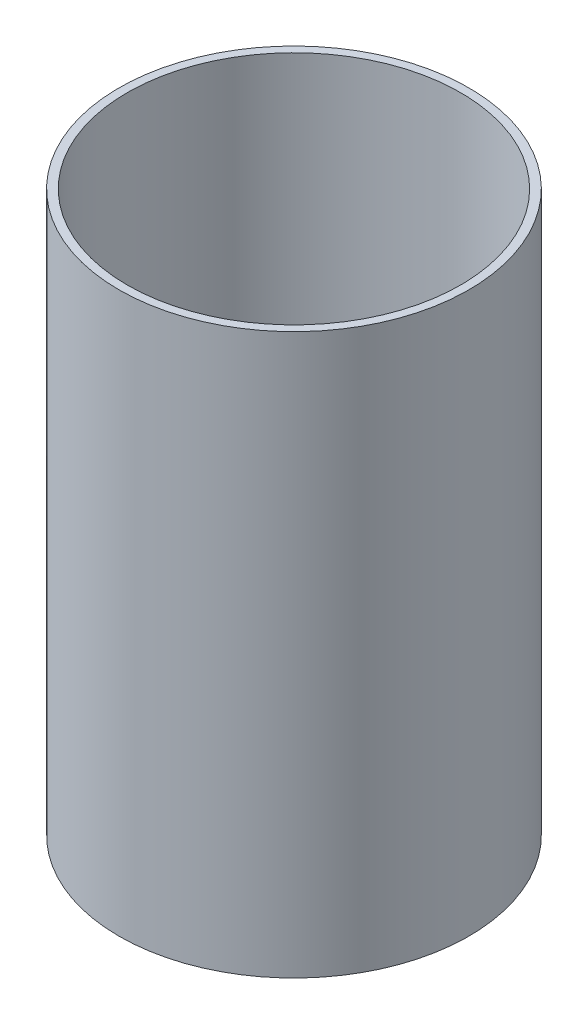
ISO-10303-21;
HEADER;
FILE_DESCRIPTION(('STEP AP214'),'2;1');
FILE_NAME('part.step','',(''),(''),'','','');
FILE_SCHEMA(('AUTOMOTIVE_DESIGN { 1 0 10303 214 1 1 1 1 }'));
ENDSEC;
DATA;
#1=APPLICATION_CONTEXT('core data for automotive mechanical design processes');
#2=APPLICATION_PROTOCOL_DEFINITION('international standard','automotive_design',2000,#1);
#3=PRODUCT_CONTEXT('',#1,'mechanical');
#4=PRODUCT('Part','Part','',(#3));
#5=PRODUCT_RELATED_PRODUCT_CATEGORY('part','',(#4));
#6=PRODUCT_DEFINITION_FORMATION('','',#4);
#7=PRODUCT_DEFINITION_CONTEXT('part definition',#1,'design');
#8=PRODUCT_DEFINITION('design','',#6,#7);
#9=PRODUCT_DEFINITION_SHAPE('','',#8);
#10=(LENGTH_UNIT() NAMED_UNIT(*) SI_UNIT(.MILLI.,.METRE.));
#11=(NAMED_UNIT(*) PLANE_ANGLE_UNIT() SI_UNIT($,.RADIAN.));
#12=(NAMED_UNIT(*) SI_UNIT($,.STERADIAN.) SOLID_ANGLE_UNIT());
#13=UNCERTAINTY_MEASURE_WITH_UNIT(LENGTH_MEASURE(1.E-05),#10,'distance_accuracy_value','');
#14=(GEOMETRIC_REPRESENTATION_CONTEXT(3) GLOBAL_UNCERTAINTY_ASSIGNED_CONTEXT((#13)) GLOBAL_UNIT_ASSIGNED_CONTEXT((#10,
#11,#12)) REPRESENTATION_CONTEXT('',''));
#15=CARTESIAN_POINT('',(0.,0.,0.));
#16=DIRECTION('',(0.,0.,1.));
#17=DIRECTION('',(1.,0.,0.));
#18=AXIS2_PLACEMENT_3D('',#15,#16,#17);
#19=CARTESIAN_POINT('',(0.,203.2,0.));
#20=DIRECTION('',(0.,1.,0.));
#21=DIRECTION('',(0.,0.,1.));
#22=AXIS2_PLACEMENT_3D('',#19,#20,#21);
#23=PLANE('',#22);
#24=CARTESIAN_POINT('',(0.,203.2,0.));
#25=DIRECTION('',(0.,1.,0.));
#26=DIRECTION('',(0.,0.,1.));
#27=AXIS2_PLACEMENT_3D('',#24,#25,#26);
#28=CIRCLE('',#27,63.5);
#29=CARTESIAN_POINT('',(0.,203.2,63.5));
#30=VERTEX_POINT('',#29);
#31=EDGE_CURVE('E10',#30,#30,#28,.T.);
#32=ORIENTED_EDGE('',*,*,#31,.T.);
#33=EDGE_LOOP('',(#32));
#34=FACE_BOUND('',#33,.T.);
#35=CARTESIAN_POINT('',(0.,203.2,0.));
#36=DIRECTION('',(0.,1.,0.));
#37=DIRECTION('',(0.,0.,1.));
#38=AXIS2_PLACEMENT_3D('',#35,#36,#37);
#39=CIRCLE('',#38,60.5028);
#40=CARTESIAN_POINT('',(0.,203.2,60.5028));
#41=VERTEX_POINT('',#40);
#42=EDGE_CURVE('E41',#41,#41,#39,.T.);
#43=ORIENTED_EDGE('',*,*,#42,.F.);
#44=EDGE_LOOP('',(#43));
#45=FACE_BOUND('',#44,.T.);
#46=ADVANCED_FACE('F30',(#34,#45),#23,.T.);
#47=CARTESIAN_POINT('',(0.,0.,0.));
#48=DIRECTION('',(0.,1.,0.));
#49=DIRECTION('',(0.,0.,1.));
#50=AXIS2_PLACEMENT_3D('',#47,#48,#49);
#51=PLANE('',#50);
#52=CARTESIAN_POINT('',(0.,0.,0.));
#53=DIRECTION('',(0.,1.,0.));
#54=DIRECTION('',(0.,0.,1.));
#55=AXIS2_PLACEMENT_3D('',#52,#53,#54);
#56=CIRCLE('',#55,63.5);
#57=CARTESIAN_POINT('',(0.,0.,63.5));
#58=VERTEX_POINT('',#57);
#59=EDGE_CURVE('E34',#58,#58,#56,.T.);
#60=ORIENTED_EDGE('',*,*,#59,.F.);
#61=EDGE_LOOP('',(#60));
#62=FACE_BOUND('',#61,.T.);
#63=CARTESIAN_POINT('',(0.,0.,0.));
#64=DIRECTION('',(0.,1.,0.));
#65=DIRECTION('',(0.,0.,1.));
#66=AXIS2_PLACEMENT_3D('',#63,#64,#65);
#67=CIRCLE('',#66,60.5028);
#68=CARTESIAN_POINT('',(0.,0.,60.5028));
#69=VERTEX_POINT('',#68);
#70=EDGE_CURVE('E43',#69,#69,#67,.T.);
#71=ORIENTED_EDGE('',*,*,#70,.T.);
#72=EDGE_LOOP('',(#71));
#73=FACE_BOUND('',#72,.T.);
#74=ADVANCED_FACE('F53',(#62,#73),#51,.F.);
#75=CARTESIAN_POINT('',(0.,203.2,0.));
#76=DIRECTION('',(0.,-1.,0.));
#77=DIRECTION('',(0.,0.,-1.));
#78=AXIS2_PLACEMENT_3D('',#75,#76,#77);
#79=CYLINDRICAL_SURFACE('',#78,63.5);
#80=ORIENTED_EDGE('',*,*,#31,.F.);
#81=EDGE_LOOP('',(#80));
#82=FACE_BOUND('',#81,.T.);
#83=ORIENTED_EDGE('',*,*,#59,.T.);
#84=EDGE_LOOP('',(#83));
#85=FACE_BOUND('',#84,.T.);
#86=ADVANCED_FACE('F32',(#82,#85),#79,.T.);
#87=CARTESIAN_POINT('',(0.,203.2,0.));
#88=DIRECTION('',(0.,-1.,0.));
#89=DIRECTION('',(0.,0.,-1.));
#90=AXIS2_PLACEMENT_3D('',#87,#88,#89);
#91=CYLINDRICAL_SURFACE('',#90,60.5028);
#92=ORIENTED_EDGE('',*,*,#42,.T.);
#93=EDGE_LOOP('',(#92));
#94=FACE_BOUND('',#93,.T.);
#95=ORIENTED_EDGE('',*,*,#70,.F.);
#96=EDGE_LOOP('',(#95));
#97=FACE_BOUND('',#96,.T.);
#98=ADVANCED_FACE('F49',(#94,#97),#91,.F.);
#99=CLOSED_SHELL('',(#46,#74,#86,#98));
#100=MANIFOLD_SOLID_BREP('B2',#99);
#101=ADVANCED_BREP_SHAPE_REPRESENTATION('',(#18,#100),#14);
#102=SHAPE_DEFINITION_REPRESENTATION(#9,#101);
ENDSEC;
END-ISO-10303-21;
